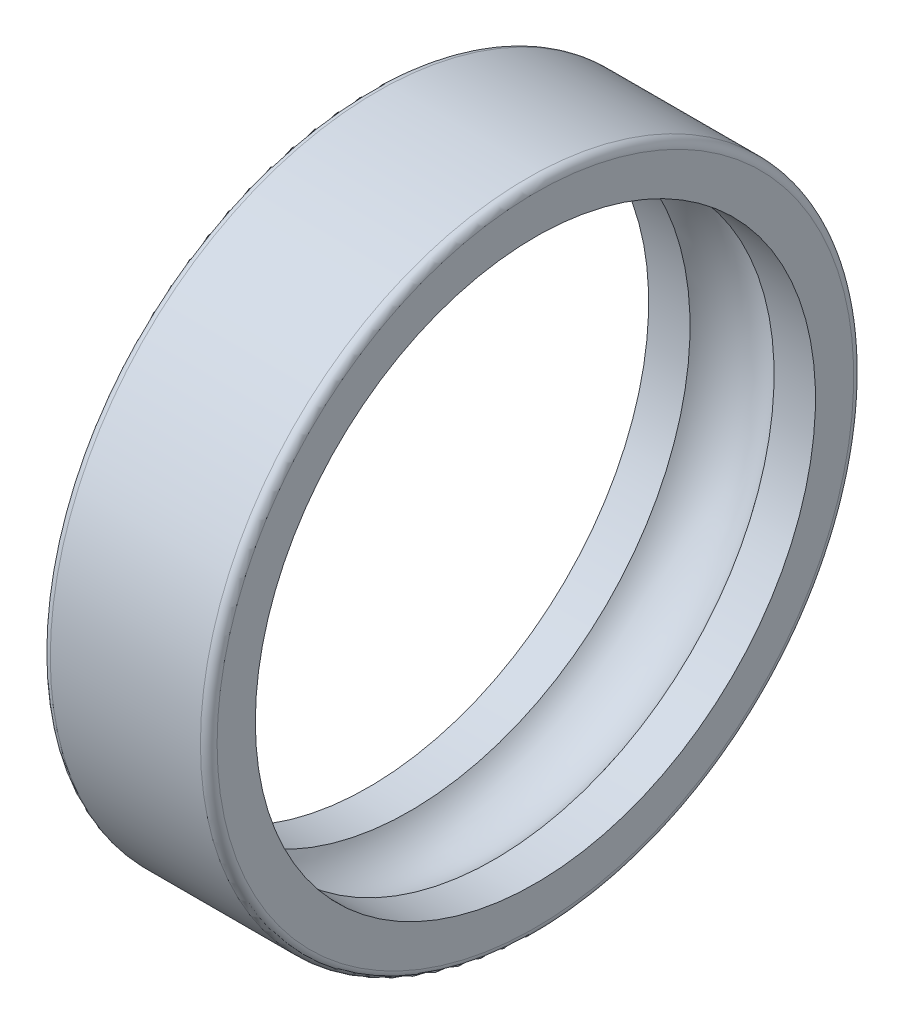
ISO-10303-21;
HEADER;
FILE_DESCRIPTION(('STEP AP214'),'2;1');
FILE_NAME('part.step','',(''),(''),'','','');
FILE_SCHEMA(('AUTOMOTIVE_DESIGN { 1 0 10303 214 1 1 1 1 }'));
ENDSEC;
DATA;
#1=APPLICATION_CONTEXT('core data for automotive mechanical design processes');
#2=APPLICATION_PROTOCOL_DEFINITION('international standard','automotive_design',2000,#1);
#3=PRODUCT_CONTEXT('',#1,'mechanical');
#4=PRODUCT('Part','Part','',(#3));
#5=PRODUCT_RELATED_PRODUCT_CATEGORY('part','',(#4));
#6=PRODUCT_DEFINITION_FORMATION('','',#4);
#7=PRODUCT_DEFINITION_CONTEXT('part definition',#1,'design');
#8=PRODUCT_DEFINITION('design','',#6,#7);
#9=PRODUCT_DEFINITION_SHAPE('','',#8);
#10=(LENGTH_UNIT() NAMED_UNIT(*) SI_UNIT(.MILLI.,.METRE.));
#11=(NAMED_UNIT(*) PLANE_ANGLE_UNIT() SI_UNIT($,.RADIAN.));
#12=(NAMED_UNIT(*) SI_UNIT($,.STERADIAN.) SOLID_ANGLE_UNIT());
#13=UNCERTAINTY_MEASURE_WITH_UNIT(LENGTH_MEASURE(1.E-05),#10,'distance_accuracy_value','');
#14=(GEOMETRIC_REPRESENTATION_CONTEXT(3) GLOBAL_UNCERTAINTY_ASSIGNED_CONTEXT((#13)) GLOBAL_UNIT_ASSIGNED_CONTEXT((#10,
#11,#12)) REPRESENTATION_CONTEXT('',''));
#15=CARTESIAN_POINT('',(0.,0.,0.));
#16=DIRECTION('',(0.,0.,1.));
#17=DIRECTION('',(1.,0.,0.));
#18=AXIS2_PLACEMENT_3D('',#15,#16,#17);
#19=CARTESIAN_POINT('',(0.,22.9000000000001,0.));
#20=DIRECTION('',(1.,0.,0.));
#21=DIRECTION('',(0.,0.,-1.));
#22=AXIS2_PLACEMENT_3D('',#19,#20,#21);
#23=PLANE('',#22);
#24=CARTESIAN_POINT('',(0.,0.,0.));
#25=DIRECTION('',(-1.,0.,0.));
#26=DIRECTION('',(0.,0.,1.));
#27=AXIS2_PLACEMENT_3D('',#24,#25,#26);
#28=CIRCLE('',#27,20.15);
#29=CARTESIAN_POINT('',(0.,0.,20.15));
#30=VERTEX_POINT('',#29);
#31=EDGE_CURVE('E10',#30,#30,#28,.T.);
#32=ORIENTED_EDGE('',*,*,#31,.F.);
#33=EDGE_LOOP('',(#32));
#34=FACE_BOUND('',#33,.T.);
#35=CARTESIAN_POINT('',(0.,0.,0.));
#36=DIRECTION('',(-1.,0.,0.));
#37=DIRECTION('',(0.,0.,1.));
#38=AXIS2_PLACEMENT_3D('',#35,#36,#37);
#39=CIRCLE('',#38,22.9);
#40=CARTESIAN_POINT('',(0.,0.,22.9000000000001));
#41=VERTEX_POINT('',#40);
#42=EDGE_CURVE('E42',#41,#41,#39,.T.);
#43=ORIENTED_EDGE('',*,*,#42,.T.);
#44=EDGE_LOOP('',(#43));
#45=FACE_BOUND('',#44,.T.);
#46=ADVANCED_FACE('F14',(#34,#45),#23,.F.);
#47=CARTESIAN_POINT('',(0.,0.,0.));
#48=DIRECTION('',(-1.,0.,0.));
#49=DIRECTION('',(0.,0.,1.));
#50=AXIS2_PLACEMENT_3D('',#47,#48,#49);
#51=CYLINDRICAL_SURFACE('',#50,20.15);
#52=CARTESIAN_POINT('',(2.97695196127411,0.,0.));
#53=DIRECTION('',(-1.,0.,0.));
#54=DIRECTION('',(0.,0.,1.));
#55=AXIS2_PLACEMENT_3D('',#52,#53,#54);
#56=CIRCLE('',#55,20.15);
#57=CARTESIAN_POINT('',(2.97695196127411,0.,20.15));
#58=VERTEX_POINT('',#57);
#59=EDGE_CURVE('E20',#58,#58,#56,.T.);
#60=ORIENTED_EDGE('',*,*,#59,.F.);
#61=EDGE_LOOP('',(#60));
#62=FACE_BOUND('',#61,.T.);
#63=ORIENTED_EDGE('',*,*,#31,.T.);
#64=EDGE_LOOP('',(#63));
#65=FACE_BOUND('',#64,.T.);
#66=ADVANCED_FACE('F79',(#62,#65),#51,.F.);
#67=CARTESIAN_POINT('',(6.,0.,0.));
#68=DIRECTION('',(-1.,0.,0.));
#69=DIRECTION('',(0.,0.,1.));
#70=AXIS2_PLACEMENT_3D('',#67,#68,#69);
#71=TOROIDAL_SURFACE('',#70,18.075,3.66666666666666);
#72=ORIENTED_EDGE('',*,*,#59,.T.);
#73=EDGE_LOOP('',(#72));
#74=FACE_BOUND('',#73,.T.);
#75=CARTESIAN_POINT('',(9.02304803872589,0.,0.));
#76=DIRECTION('',(-1.,0.,0.));
#77=DIRECTION('',(0.,0.,1.));
#78=AXIS2_PLACEMENT_3D('',#75,#76,#77);
#79=CIRCLE('',#78,20.15);
#80=CARTESIAN_POINT('',(9.02304803872589,0.,20.15));
#81=VERTEX_POINT('',#80);
#82=EDGE_CURVE('E24',#81,#81,#79,.T.);
#83=ORIENTED_EDGE('',*,*,#82,.F.);
#84=EDGE_LOOP('',(#83));
#85=FACE_BOUND('',#84,.T.);
#86=ADVANCED_FACE('F74',(#74,#85),#71,.F.);
#87=CARTESIAN_POINT('',(0.,0.,0.));
#88=DIRECTION('',(-1.,0.,0.));
#89=DIRECTION('',(0.,0.,1.));
#90=AXIS2_PLACEMENT_3D('',#87,#88,#89);
#91=CYLINDRICAL_SURFACE('',#90,20.15);
#92=CARTESIAN_POINT('',(12.,0.,0.));
#93=DIRECTION('',(-1.,0.,0.));
#94=DIRECTION('',(0.,0.,1.));
#95=AXIS2_PLACEMENT_3D('',#92,#93,#94);
#96=CIRCLE('',#95,20.15);
#97=CARTESIAN_POINT('',(12.,0.,20.15));
#98=VERTEX_POINT('',#97);
#99=EDGE_CURVE('E28',#98,#98,#96,.T.);
#100=ORIENTED_EDGE('',*,*,#99,.F.);
#101=EDGE_LOOP('',(#100));
#102=FACE_BOUND('',#101,.T.);
#103=ORIENTED_EDGE('',*,*,#82,.T.);
#104=EDGE_LOOP('',(#103));
#105=FACE_BOUND('',#104,.T.);
#106=ADVANCED_FACE('F68',(#102,#105),#91,.F.);
#107=CARTESIAN_POINT('',(12.,20.1500000000001,0.));
#108=DIRECTION('',(-1.,0.,0.));
#109=DIRECTION('',(0.,0.,1.));
#110=AXIS2_PLACEMENT_3D('',#107,#108,#109);
#111=PLANE('',#110);
#112=CARTESIAN_POINT('',(12.,0.,0.));
#113=DIRECTION('',(-1.,0.,0.));
#114=DIRECTION('',(0.,0.,1.));
#115=AXIS2_PLACEMENT_3D('',#112,#113,#114);
#116=CIRCLE('',#115,22.9);
#117=CARTESIAN_POINT('',(12.,0.,22.9000000000001));
#118=VERTEX_POINT('',#117);
#119=EDGE_CURVE('E33',#118,#118,#116,.T.);
#120=ORIENTED_EDGE('',*,*,#119,.F.);
#121=EDGE_LOOP('',(#120));
#122=FACE_BOUND('',#121,.T.);
#123=ORIENTED_EDGE('',*,*,#99,.T.);
#124=EDGE_LOOP('',(#123));
#125=FACE_BOUND('',#124,.T.);
#126=ADVANCED_FACE('F62',(#122,#125),#111,.F.);
#127=CARTESIAN_POINT('',(11.4,0.,0.));
#128=DIRECTION('',(-1.,0.,0.));
#129=DIRECTION('',(0.,0.,1.));
#130=AXIS2_PLACEMENT_3D('',#127,#128,#129);
#131=TOROIDAL_SURFACE('',#130,22.9,0.6);
#132=CARTESIAN_POINT('',(11.4,0.,0.));
#133=DIRECTION('',(-1.,0.,0.));
#134=DIRECTION('',(0.,0.,1.));
#135=AXIS2_PLACEMENT_3D('',#132,#133,#134);
#136=CIRCLE('',#135,23.5);
#137=CARTESIAN_POINT('',(11.4,0.,23.5000000000001));
#138=VERTEX_POINT('',#137);
#139=EDGE_CURVE('E36',#138,#138,#136,.T.);
#140=ORIENTED_EDGE('',*,*,#139,.F.);
#141=EDGE_LOOP('',(#140));
#142=FACE_BOUND('',#141,.T.);
#143=ORIENTED_EDGE('',*,*,#119,.T.);
#144=EDGE_LOOP('',(#143));
#145=FACE_BOUND('',#144,.T.);
#146=ADVANCED_FACE('F56',(#142,#145),#131,.T.);
#147=CARTESIAN_POINT('',(0.,0.,0.));
#148=DIRECTION('',(-1.,0.,0.));
#149=DIRECTION('',(0.,0.,1.));
#150=AXIS2_PLACEMENT_3D('',#147,#148,#149);
#151=CYLINDRICAL_SURFACE('',#150,23.5);
#152=CARTESIAN_POINT('',(0.6,0.,0.));
#153=DIRECTION('',(-1.,0.,0.));
#154=DIRECTION('',(0.,0.,1.));
#155=AXIS2_PLACEMENT_3D('',#152,#153,#154);
#156=CIRCLE('',#155,23.5);
#157=CARTESIAN_POINT('',(0.6,0.,23.5000000000001));
#158=VERTEX_POINT('',#157);
#159=EDGE_CURVE('E39',#158,#158,#156,.T.);
#160=ORIENTED_EDGE('',*,*,#159,.F.);
#161=EDGE_LOOP('',(#160));
#162=FACE_BOUND('',#161,.T.);
#163=ORIENTED_EDGE('',*,*,#139,.T.);
#164=EDGE_LOOP('',(#163));
#165=FACE_BOUND('',#164,.T.);
#166=ADVANCED_FACE('F50',(#162,#165),#151,.T.);
#167=CARTESIAN_POINT('',(0.6,0.,0.));
#168=DIRECTION('',(-1.,0.,0.));
#169=DIRECTION('',(0.,0.,1.));
#170=AXIS2_PLACEMENT_3D('',#167,#168,#169);
#171=TOROIDAL_SURFACE('',#170,22.9,0.6);
#172=ORIENTED_EDGE('',*,*,#42,.F.);
#173=EDGE_LOOP('',(#172));
#174=FACE_BOUND('',#173,.T.);
#175=ORIENTED_EDGE('',*,*,#159,.T.);
#176=EDGE_LOOP('',(#175));
#177=FACE_BOUND('',#176,.T.);
#178=ADVANCED_FACE('F47',(#174,#177),#171,.T.);
#179=CLOSED_SHELL('',(#46,#66,#86,#106,#126,#146,#166,#178));
#180=MANIFOLD_SOLID_BREP('B1',#179);
#181=ADVANCED_BREP_SHAPE_REPRESENTATION('',(#18,#180),#14);
#182=SHAPE_DEFINITION_REPRESENTATION(#9,#181);
ENDSEC;
END-ISO-10303-21;
